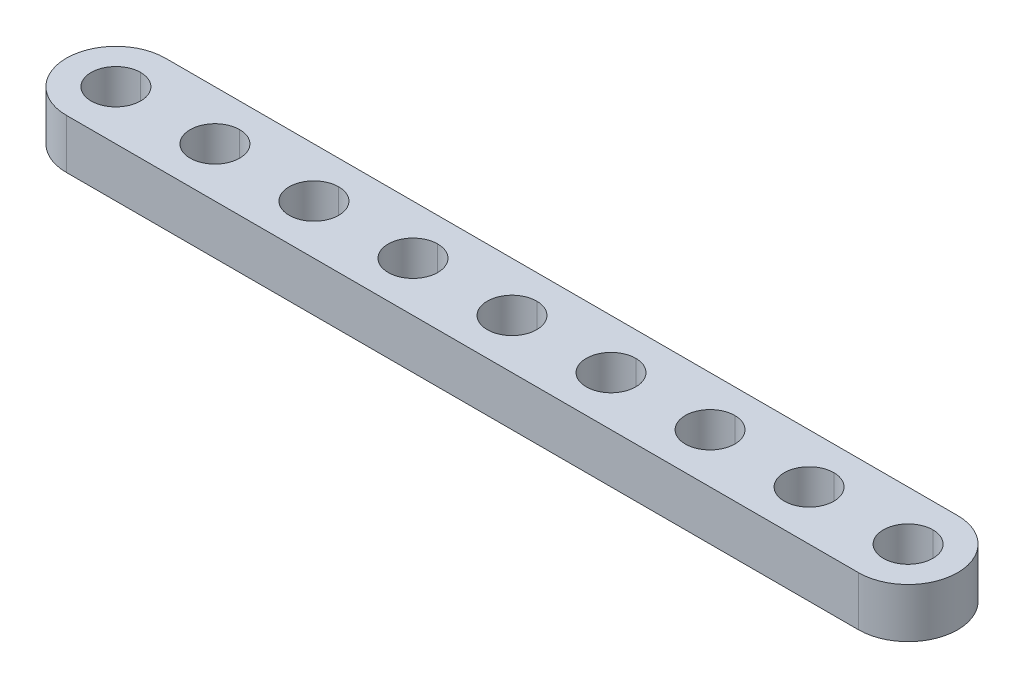
ISO-10303-21;
HEADER;
FILE_DESCRIPTION(('STEP AP214'),'2;1');
FILE_NAME('part.step','',(''),(''),'','','');
FILE_SCHEMA(('AUTOMOTIVE_DESIGN { 1 0 10303 214 1 1 1 1 }'));
ENDSEC;
DATA;
#1=APPLICATION_CONTEXT('core data for automotive mechanical design processes');
#2=APPLICATION_PROTOCOL_DEFINITION('international standard','automotive_design',2000,#1);
#3=PRODUCT_CONTEXT('',#1,'mechanical');
#4=PRODUCT('Part','Part','',(#3));
#5=PRODUCT_RELATED_PRODUCT_CATEGORY('part','',(#4));
#6=PRODUCT_DEFINITION_FORMATION('','',#4);
#7=PRODUCT_DEFINITION_CONTEXT('part definition',#1,'design');
#8=PRODUCT_DEFINITION('design','',#6,#7);
#9=PRODUCT_DEFINITION_SHAPE('','',#8);
#10=(LENGTH_UNIT() NAMED_UNIT(*) SI_UNIT(.MILLI.,.METRE.));
#11=(NAMED_UNIT(*) PLANE_ANGLE_UNIT() SI_UNIT($,.RADIAN.));
#12=(NAMED_UNIT(*) SI_UNIT($,.STERADIAN.) SOLID_ANGLE_UNIT());
#13=UNCERTAINTY_MEASURE_WITH_UNIT(LENGTH_MEASURE(1.E-05),#10,'distance_accuracy_value','');
#14=(GEOMETRIC_REPRESENTATION_CONTEXT(3) GLOBAL_UNCERTAINTY_ASSIGNED_CONTEXT((#13)) GLOBAL_UNIT_ASSIGNED_CONTEXT((#10,
#11,#12)) REPRESENTATION_CONTEXT('',''));
#15=CARTESIAN_POINT('',(0.,0.,0.));
#16=DIRECTION('',(0.,0.,1.));
#17=DIRECTION('',(1.,0.,0.));
#18=AXIS2_PLACEMENT_3D('',#15,#16,#17);
#19=CARTESIAN_POINT('',(32.,4.,0.));
#20=DIRECTION('',(0.,1.,0.));
#21=DIRECTION('',(0.,0.,1.));
#22=AXIS2_PLACEMENT_3D('',#19,#20,#21);
#23=CYLINDRICAL_SURFACE('',#22,2.);
#24=DIRECTION('',(0.,1.,0.));
#25=VECTOR('',#24,1.);
#26=CARTESIAN_POINT('',(32.,4.,-2.));
#27=LINE('',#26,#25);
#28=CARTESIAN_POINT('',(32.,0.,-2.));
#29=VERTEX_POINT('',#28);
#30=CARTESIAN_POINT('',(32.,4.,-2.));
#31=VERTEX_POINT('',#30);
#32=EDGE_CURVE('E254',#29,#31,#27,.T.);
#33=ORIENTED_EDGE('',*,*,#32,.F.);
#34=CARTESIAN_POINT('',(32.,0.,0.));
#35=DIRECTION('',(0.,1.,0.));
#36=DIRECTION('',(0.,0.,1.));
#37=AXIS2_PLACEMENT_3D('',#34,#35,#36);
#38=CIRCLE('',#37,2.);
#39=CARTESIAN_POINT('',(32.,0.,2.));
#40=VERTEX_POINT('',#39);
#41=EDGE_CURVE('E212',#40,#29,#38,.T.);
#42=ORIENTED_EDGE('',*,*,#41,.F.);
#43=DIRECTION('',(0.,1.,0.));
#44=VECTOR('',#43,1.);
#45=CARTESIAN_POINT('',(32.,4.,2.));
#46=LINE('',#45,#44);
#47=CARTESIAN_POINT('',(32.,4.,2.));
#48=VERTEX_POINT('',#47);
#49=EDGE_CURVE('E305',#40,#48,#46,.T.);
#50=ORIENTED_EDGE('',*,*,#49,.T.);
#51=CARTESIAN_POINT('',(32.,4.,0.));
#52=DIRECTION('',(0.,1.,0.));
#53=DIRECTION('',(0.,0.,1.));
#54=AXIS2_PLACEMENT_3D('',#51,#52,#53);
#55=CIRCLE('',#54,2.);
#56=EDGE_CURVE('E237',#48,#31,#55,.T.);
#57=ORIENTED_EDGE('',*,*,#56,.T.);
#58=EDGE_LOOP('',(#33,#42,#50,#57));
#59=FACE_BOUND('',#58,.T.);
#60=ADVANCED_FACE('F15',(#59),#23,.F.);
#61=CARTESIAN_POINT('',(24.,4.,0.));
#62=DIRECTION('',(0.,1.,0.));
#63=DIRECTION('',(0.,0.,1.));
#64=AXIS2_PLACEMENT_3D('',#61,#62,#63);
#65=CYLINDRICAL_SURFACE('',#64,2.);
#66=DIRECTION('',(0.,1.,0.));
#67=VECTOR('',#66,1.);
#68=CARTESIAN_POINT('',(24.,4.,-2.));
#69=LINE('',#68,#67);
#70=CARTESIAN_POINT('',(24.,0.,-2.));
#71=VERTEX_POINT('',#70);
#72=CARTESIAN_POINT('',(24.,4.,-2.));
#73=VERTEX_POINT('',#72);
#74=EDGE_CURVE('E19',#71,#73,#69,.T.);
#75=ORIENTED_EDGE('',*,*,#74,.F.);
#76=CARTESIAN_POINT('',(24.,0.,0.));
#77=DIRECTION('',(0.,1.,0.));
#78=DIRECTION('',(0.,0.,1.));
#79=AXIS2_PLACEMENT_3D('',#76,#77,#78);
#80=CIRCLE('',#79,2.);
#81=CARTESIAN_POINT('',(24.,0.,2.));
#82=VERTEX_POINT('',#81);
#83=EDGE_CURVE('E209',#82,#71,#80,.T.);
#84=ORIENTED_EDGE('',*,*,#83,.F.);
#85=DIRECTION('',(0.,1.,0.));
#86=VECTOR('',#85,1.);
#87=CARTESIAN_POINT('',(24.,4.,2.));
#88=LINE('',#87,#86);
#89=CARTESIAN_POINT('',(24.,4.,2.));
#90=VERTEX_POINT('',#89);
#91=EDGE_CURVE('E366',#82,#90,#88,.T.);
#92=ORIENTED_EDGE('',*,*,#91,.T.);
#93=CARTESIAN_POINT('',(24.,4.,0.));
#94=DIRECTION('',(0.,1.,0.));
#95=DIRECTION('',(0.,0.,1.));
#96=AXIS2_PLACEMENT_3D('',#93,#94,#95);
#97=CIRCLE('',#96,2.);
#98=EDGE_CURVE('E241',#90,#73,#97,.T.);
#99=ORIENTED_EDGE('',*,*,#98,.T.);
#100=EDGE_LOOP('',(#75,#84,#92,#99));
#101=FACE_BOUND('',#100,.T.);
#102=ADVANCED_FACE('F540',(#101),#65,.F.);
#103=CARTESIAN_POINT('',(16.,4.,0.));
#104=DIRECTION('',(0.,1.,0.));
#105=DIRECTION('',(0.,0.,1.));
#106=AXIS2_PLACEMENT_3D('',#103,#104,#105);
#107=CYLINDRICAL_SURFACE('',#106,2.);
#108=DIRECTION('',(0.,1.,0.));
#109=VECTOR('',#108,1.);
#110=CARTESIAN_POINT('',(16.,4.,-2.));
#111=LINE('',#110,#109);
#112=CARTESIAN_POINT('',(16.,0.,-2.));
#113=VERTEX_POINT('',#112);
#114=CARTESIAN_POINT('',(16.,4.,-2.));
#115=VERTEX_POINT('',#114);
#116=EDGE_CURVE('E447',#113,#115,#111,.T.);
#117=ORIENTED_EDGE('',*,*,#116,.F.);
#118=CARTESIAN_POINT('',(16.,0.,0.));
#119=DIRECTION('',(0.,1.,0.));
#120=DIRECTION('',(0.,0.,1.));
#121=AXIS2_PLACEMENT_3D('',#118,#119,#120);
#122=CIRCLE('',#121,2.);
#123=CARTESIAN_POINT('',(16.,0.,2.));
#124=VERTEX_POINT('',#123);
#125=EDGE_CURVE('E211',#124,#113,#122,.T.);
#126=ORIENTED_EDGE('',*,*,#125,.F.);
#127=DIRECTION('',(0.,1.,0.));
#128=VECTOR('',#127,1.);
#129=CARTESIAN_POINT('',(16.,4.,2.));
#130=LINE('',#129,#128);
#131=CARTESIAN_POINT('',(16.,4.,2.));
#132=VERTEX_POINT('',#131);
#133=EDGE_CURVE('E398',#124,#132,#130,.T.);
#134=ORIENTED_EDGE('',*,*,#133,.T.);
#135=CARTESIAN_POINT('',(16.,4.,0.));
#136=DIRECTION('',(0.,1.,0.));
#137=DIRECTION('',(0.,0.,1.));
#138=AXIS2_PLACEMENT_3D('',#135,#136,#137);
#139=CIRCLE('',#138,2.);
#140=EDGE_CURVE('E257',#132,#115,#139,.T.);
#141=ORIENTED_EDGE('',*,*,#140,.T.);
#142=EDGE_LOOP('',(#117,#126,#134,#141));
#143=FACE_BOUND('',#142,.T.);
#144=ADVANCED_FACE('F444',(#143),#107,.F.);
#145=CARTESIAN_POINT('',(8.,4.,0.));
#146=DIRECTION('',(0.,1.,0.));
#147=DIRECTION('',(0.,0.,1.));
#148=AXIS2_PLACEMENT_3D('',#145,#146,#147);
#149=CYLINDRICAL_SURFACE('',#148,2.);
#150=DIRECTION('',(0.,1.,0.));
#151=VECTOR('',#150,1.);
#152=CARTESIAN_POINT('',(8.,4.,-2.));
#153=LINE('',#152,#151);
#154=CARTESIAN_POINT('',(8.,0.,-2.));
#155=VERTEX_POINT('',#154);
#156=CARTESIAN_POINT('',(8.,4.,-2.));
#157=VERTEX_POINT('',#156);
#158=EDGE_CURVE('E285',#155,#157,#153,.T.);
#159=ORIENTED_EDGE('',*,*,#158,.F.);
#160=CARTESIAN_POINT('',(8.,0.,0.));
#161=DIRECTION('',(0.,1.,0.));
#162=DIRECTION('',(0.,0.,1.));
#163=AXIS2_PLACEMENT_3D('',#160,#161,#162);
#164=CIRCLE('',#163,2.);
#165=CARTESIAN_POINT('',(8.,0.,2.));
#166=VERTEX_POINT('',#165);
#167=EDGE_CURVE('E300',#166,#155,#164,.T.);
#168=ORIENTED_EDGE('',*,*,#167,.F.);
#169=DIRECTION('',(0.,1.,0.));
#170=VECTOR('',#169,1.);
#171=CARTESIAN_POINT('',(8.,4.,2.));
#172=LINE('',#171,#170);
#173=CARTESIAN_POINT('',(8.,4.,2.));
#174=VERTEX_POINT('',#173);
#175=EDGE_CURVE('E227',#166,#174,#172,.T.);
#176=ORIENTED_EDGE('',*,*,#175,.T.);
#177=CARTESIAN_POINT('',(8.,4.,0.));
#178=DIRECTION('',(0.,1.,0.));
#179=DIRECTION('',(0.,0.,1.));
#180=AXIS2_PLACEMENT_3D('',#177,#178,#179);
#181=CIRCLE('',#180,2.);
#182=EDGE_CURVE('E259',#174,#157,#181,.T.);
#183=ORIENTED_EDGE('',*,*,#182,.T.);
#184=EDGE_LOOP('',(#159,#168,#176,#183));
#185=FACE_BOUND('',#184,.T.);
#186=ADVANCED_FACE('F518',(#185),#149,.F.);
#187=CARTESIAN_POINT('',(0.,4.,0.));
#188=DIRECTION('',(0.,1.,0.));
#189=DIRECTION('',(0.,0.,1.));
#190=AXIS2_PLACEMENT_3D('',#187,#188,#189);
#191=CYLINDRICAL_SURFACE('',#190,2.);
#192=DIRECTION('',(0.,1.,0.));
#193=VECTOR('',#192,1.);
#194=CARTESIAN_POINT('',(0.,4.,-2.));
#195=LINE('',#194,#193);
#196=CARTESIAN_POINT('',(0.,0.,-2.));
#197=VERTEX_POINT('',#196);
#198=CARTESIAN_POINT('',(0.,4.,-2.));
#199=VERTEX_POINT('',#198);
#200=EDGE_CURVE('E213',#197,#199,#195,.T.);
#201=ORIENTED_EDGE('',*,*,#200,.F.);
#202=CARTESIAN_POINT('',(0.,0.,0.));
#203=DIRECTION('',(0.,1.,0.));
#204=DIRECTION('',(0.,0.,1.));
#205=AXIS2_PLACEMENT_3D('',#202,#203,#204);
#206=CIRCLE('',#205,2.);
#207=CARTESIAN_POINT('',(0.,0.,2.));
#208=VERTEX_POINT('',#207);
#209=EDGE_CURVE('E178',#208,#197,#206,.T.);
#210=ORIENTED_EDGE('',*,*,#209,.F.);
#211=DIRECTION('',(0.,1.,0.));
#212=VECTOR('',#211,1.);
#213=CARTESIAN_POINT('',(0.,4.,2.));
#214=LINE('',#213,#212);
#215=CARTESIAN_POINT('',(0.,4.,2.));
#216=VERTEX_POINT('',#215);
#217=EDGE_CURVE('E195',#208,#216,#214,.T.);
#218=ORIENTED_EDGE('',*,*,#217,.T.);
#219=CARTESIAN_POINT('',(0.,4.,0.));
#220=DIRECTION('',(0.,1.,0.));
#221=DIRECTION('',(0.,0.,1.));
#222=AXIS2_PLACEMENT_3D('',#219,#220,#221);
#223=CIRCLE('',#222,2.);
#224=EDGE_CURVE('E278',#216,#199,#223,.T.);
#225=ORIENTED_EDGE('',*,*,#224,.T.);
#226=EDGE_LOOP('',(#201,#210,#218,#225));
#227=FACE_BOUND('',#226,.T.);
#228=ADVANCED_FACE('F575',(#227),#191,.F.);
#229=CARTESIAN_POINT('',(-8.,4.,0.));
#230=DIRECTION('',(0.,1.,0.));
#231=DIRECTION('',(0.,0.,1.));
#232=AXIS2_PLACEMENT_3D('',#229,#230,#231);
#233=CYLINDRICAL_SURFACE('',#232,2.);
#234=DIRECTION('',(0.,1.,0.));
#235=VECTOR('',#234,1.);
#236=CARTESIAN_POINT('',(-8.,4.,-2.));
#237=LINE('',#236,#235);
#238=CARTESIAN_POINT('',(-8.,0.,-2.));
#239=VERTEX_POINT('',#238);
#240=CARTESIAN_POINT('',(-8.,4.,-2.));
#241=VERTEX_POINT('',#240);
#242=EDGE_CURVE('E182',#239,#241,#237,.T.);
#243=ORIENTED_EDGE('',*,*,#242,.F.);
#244=CARTESIAN_POINT('',(-8.,0.,0.));
#245=DIRECTION('',(0.,1.,0.));
#246=DIRECTION('',(0.,0.,1.));
#247=AXIS2_PLACEMENT_3D('',#244,#245,#246);
#248=CIRCLE('',#247,2.);
#249=CARTESIAN_POINT('',(-8.,0.,2.));
#250=VERTEX_POINT('',#249);
#251=EDGE_CURVE('E167',#250,#239,#248,.T.);
#252=ORIENTED_EDGE('',*,*,#251,.F.);
#253=DIRECTION('',(0.,1.,0.));
#254=VECTOR('',#253,1.);
#255=CARTESIAN_POINT('',(-8.,4.,2.));
#256=LINE('',#255,#254);
#257=CARTESIAN_POINT('',(-8.,4.,2.));
#258=VERTEX_POINT('',#257);
#259=EDGE_CURVE('E193',#250,#258,#256,.T.);
#260=ORIENTED_EDGE('',*,*,#259,.T.);
#261=CARTESIAN_POINT('',(-8.,4.,0.));
#262=DIRECTION('',(0.,1.,0.));
#263=DIRECTION('',(0.,0.,1.));
#264=AXIS2_PLACEMENT_3D('',#261,#262,#263);
#265=CIRCLE('',#264,2.);
#266=EDGE_CURVE('E185',#258,#241,#265,.T.);
#267=ORIENTED_EDGE('',*,*,#266,.T.);
#268=EDGE_LOOP('',(#243,#252,#260,#267));
#269=FACE_BOUND('',#268,.T.);
#270=ADVANCED_FACE('F183',(#269),#233,.F.);
#271=CARTESIAN_POINT('',(-16.,4.,0.));
#272=DIRECTION('',(0.,1.,0.));
#273=DIRECTION('',(0.,0.,1.));
#274=AXIS2_PLACEMENT_3D('',#271,#272,#273);
#275=CYLINDRICAL_SURFACE('',#274,2.);
#276=DIRECTION('',(0.,1.,0.));
#277=VECTOR('',#276,1.);
#278=CARTESIAN_POINT('',(-16.,4.,-2.));
#279=LINE('',#278,#277);
#280=CARTESIAN_POINT('',(-16.,0.,-2.));
#281=VERTEX_POINT('',#280);
#282=CARTESIAN_POINT('',(-16.,4.,-2.));
#283=VERTEX_POINT('',#282);
#284=EDGE_CURVE('E339',#281,#283,#279,.T.);
#285=ORIENTED_EDGE('',*,*,#284,.F.);
#286=CARTESIAN_POINT('',(-16.,0.,0.));
#287=DIRECTION('',(0.,1.,0.));
#288=DIRECTION('',(0.,0.,1.));
#289=AXIS2_PLACEMENT_3D('',#286,#287,#288);
#290=CIRCLE('',#289,2.);
#291=CARTESIAN_POINT('',(-16.,0.,2.));
#292=VERTEX_POINT('',#291);
#293=EDGE_CURVE('E177',#292,#281,#290,.T.);
#294=ORIENTED_EDGE('',*,*,#293,.F.);
#295=DIRECTION('',(0.,1.,0.));
#296=VECTOR('',#295,1.);
#297=CARTESIAN_POINT('',(-16.,4.,2.));
#298=LINE('',#297,#296);
#299=CARTESIAN_POINT('',(-16.,4.,2.));
#300=VERTEX_POINT('',#299);
#301=EDGE_CURVE('E323',#292,#300,#298,.T.);
#302=ORIENTED_EDGE('',*,*,#301,.T.);
#303=CARTESIAN_POINT('',(-16.,4.,0.));
#304=DIRECTION('',(0.,1.,0.));
#305=DIRECTION('',(0.,0.,1.));
#306=AXIS2_PLACEMENT_3D('',#303,#304,#305);
#307=CIRCLE('',#306,2.);
#308=EDGE_CURVE('E271',#300,#283,#307,.T.);
#309=ORIENTED_EDGE('',*,*,#308,.T.);
#310=EDGE_LOOP('',(#285,#294,#302,#309));
#311=FACE_BOUND('',#310,.T.);
#312=ADVANCED_FACE('F582',(#311),#275,.F.);
#313=CARTESIAN_POINT('',(-24.,4.,0.));
#314=DIRECTION('',(0.,1.,0.));
#315=DIRECTION('',(0.,0.,1.));
#316=AXIS2_PLACEMENT_3D('',#313,#314,#315);
#317=CYLINDRICAL_SURFACE('',#316,2.);
#318=DIRECTION('',(0.,1.,0.));
#319=VECTOR('',#318,1.);
#320=CARTESIAN_POINT('',(-24.,4.,-2.));
#321=LINE('',#320,#319);
#322=CARTESIAN_POINT('',(-24.,0.,-2.));
#323=VERTEX_POINT('',#322);
#324=CARTESIAN_POINT('',(-24.,4.,-2.));
#325=VERTEX_POINT('',#324);
#326=EDGE_CURVE('E228',#323,#325,#321,.T.);
#327=ORIENTED_EDGE('',*,*,#326,.F.);
#328=CARTESIAN_POINT('',(-24.,0.,0.));
#329=DIRECTION('',(0.,1.,0.));
#330=DIRECTION('',(0.,0.,1.));
#331=AXIS2_PLACEMENT_3D('',#328,#329,#330);
#332=CIRCLE('',#331,2.);
#333=CARTESIAN_POINT('',(-24.,0.,2.));
#334=VERTEX_POINT('',#333);
#335=EDGE_CURVE('E26',#334,#323,#332,.T.);
#336=ORIENTED_EDGE('',*,*,#335,.F.);
#337=DIRECTION('',(0.,1.,0.));
#338=VECTOR('',#337,1.);
#339=CARTESIAN_POINT('',(-24.,4.,2.));
#340=LINE('',#339,#338);
#341=CARTESIAN_POINT('',(-24.,4.,2.));
#342=VERTEX_POINT('',#341);
#343=EDGE_CURVE('E261',#334,#342,#340,.T.);
#344=ORIENTED_EDGE('',*,*,#343,.T.);
#345=CARTESIAN_POINT('',(-24.,4.,0.));
#346=DIRECTION('',(0.,1.,0.));
#347=DIRECTION('',(0.,0.,1.));
#348=AXIS2_PLACEMENT_3D('',#345,#346,#347);
#349=CIRCLE('',#348,2.);
#350=EDGE_CURVE('E207',#342,#325,#349,.T.);
#351=ORIENTED_EDGE('',*,*,#350,.T.);
#352=EDGE_LOOP('',(#327,#336,#344,#351));
#353=FACE_BOUND('',#352,.T.);
#354=ADVANCED_FACE('F485',(#353),#317,.F.);
#355=CARTESIAN_POINT('',(-32.,4.,0.));
#356=DIRECTION('',(0.,1.,0.));
#357=DIRECTION('',(0.,0.,1.));
#358=AXIS2_PLACEMENT_3D('',#355,#356,#357);
#359=CYLINDRICAL_SURFACE('',#358,2.);
#360=DIRECTION('',(0.,1.,0.));
#361=VECTOR('',#360,1.);
#362=CARTESIAN_POINT('',(-32.,4.,-2.));
#363=LINE('',#362,#361);
#364=CARTESIAN_POINT('',(-32.,0.,-2.));
#365=VERTEX_POINT('',#364);
#366=CARTESIAN_POINT('',(-32.,4.,-2.));
#367=VERTEX_POINT('',#366);
#368=EDGE_CURVE('E293',#365,#367,#363,.T.);
#369=ORIENTED_EDGE('',*,*,#368,.F.);
#370=CARTESIAN_POINT('',(-32.,0.,0.));
#371=DIRECTION('',(0.,1.,0.));
#372=DIRECTION('',(0.,0.,1.));
#373=AXIS2_PLACEMENT_3D('',#370,#371,#372);
#374=CIRCLE('',#373,2.);
#375=CARTESIAN_POINT('',(-32.,0.,2.));
#376=VERTEX_POINT('',#375);
#377=EDGE_CURVE('E10',#376,#365,#374,.T.);
#378=ORIENTED_EDGE('',*,*,#377,.F.);
#379=DIRECTION('',(0.,1.,0.));
#380=VECTOR('',#379,1.);
#381=CARTESIAN_POINT('',(-32.,4.,2.));
#382=LINE('',#381,#380);
#383=CARTESIAN_POINT('',(-32.,4.,2.));
#384=VERTEX_POINT('',#383);
#385=EDGE_CURVE('E247',#376,#384,#382,.T.);
#386=ORIENTED_EDGE('',*,*,#385,.T.);
#387=CARTESIAN_POINT('',(-32.,4.,0.));
#388=DIRECTION('',(0.,1.,0.));
#389=DIRECTION('',(0.,0.,1.));
#390=AXIS2_PLACEMENT_3D('',#387,#388,#389);
#391=CIRCLE('',#390,2.);
#392=EDGE_CURVE('E371',#384,#367,#391,.T.);
#393=ORIENTED_EDGE('',*,*,#392,.T.);
#394=EDGE_LOOP('',(#369,#378,#386,#393));
#395=FACE_BOUND('',#394,.T.);
#396=ADVANCED_FACE('F527',(#395),#359,.F.);
#397=CARTESIAN_POINT('',(-32.,0.,0.));
#398=DIRECTION('',(0.,1.,0.));
#399=DIRECTION('',(1.,0.,0.));
#400=AXIS2_PLACEMENT_3D('',#397,#398,#399);
#401=PLANE('',#400);
#402=ORIENTED_EDGE('',*,*,#377,.T.);
#403=CARTESIAN_POINT('',(-32.,0.,0.));
#404=DIRECTION('',(0.,1.,0.));
#405=DIRECTION('',(0.,0.,1.));
#406=AXIS2_PLACEMENT_3D('',#403,#404,#405);
#407=CIRCLE('',#406,2.);
#408=EDGE_CURVE('E265',#365,#376,#407,.T.);
#409=ORIENTED_EDGE('',*,*,#408,.T.);
#410=EDGE_LOOP('',(#402,#409));
#411=FACE_BOUND('',#410,.T.);
#412=ORIENTED_EDGE('',*,*,#335,.T.);
#413=CARTESIAN_POINT('',(-24.,0.,0.));
#414=DIRECTION('',(0.,1.,0.));
#415=DIRECTION('',(0.,0.,1.));
#416=AXIS2_PLACEMENT_3D('',#413,#414,#415);
#417=CIRCLE('',#416,2.);
#418=EDGE_CURVE('E233',#323,#334,#417,.T.);
#419=ORIENTED_EDGE('',*,*,#418,.T.);
#420=EDGE_LOOP('',(#412,#419));
#421=FACE_BOUND('',#420,.T.);
#422=ORIENTED_EDGE('',*,*,#293,.T.);
#423=CARTESIAN_POINT('',(-16.,0.,0.));
#424=DIRECTION('',(0.,1.,0.));
#425=DIRECTION('',(0.,0.,1.));
#426=AXIS2_PLACEMENT_3D('',#423,#424,#425);
#427=CIRCLE('',#426,2.);
#428=EDGE_CURVE('E288',#281,#292,#427,.T.);
#429=ORIENTED_EDGE('',*,*,#428,.T.);
#430=EDGE_LOOP('',(#422,#429));
#431=FACE_BOUND('',#430,.T.);
#432=ORIENTED_EDGE('',*,*,#251,.T.);
#433=CARTESIAN_POINT('',(-8.,0.,0.));
#434=DIRECTION('',(0.,1.,0.));
#435=DIRECTION('',(0.,0.,1.));
#436=AXIS2_PLACEMENT_3D('',#433,#434,#435);
#437=CIRCLE('',#436,2.);
#438=EDGE_CURVE('E172',#239,#250,#437,.T.);
#439=ORIENTED_EDGE('',*,*,#438,.T.);
#440=EDGE_LOOP('',(#432,#439));
#441=FACE_BOUND('',#440,.T.);
#442=ORIENTED_EDGE('',*,*,#209,.T.);
#443=CARTESIAN_POINT('',(0.,0.,0.));
#444=DIRECTION('',(0.,1.,0.));
#445=DIRECTION('',(0.,0.,1.));
#446=AXIS2_PLACEMENT_3D('',#443,#444,#445);
#447=CIRCLE('',#446,2.);
#448=EDGE_CURVE('E217',#197,#208,#447,.T.);
#449=ORIENTED_EDGE('',*,*,#448,.T.);
#450=EDGE_LOOP('',(#442,#449));
#451=FACE_BOUND('',#450,.T.);
#452=ORIENTED_EDGE('',*,*,#167,.T.);
#453=CARTESIAN_POINT('',(8.,0.,0.));
#454=DIRECTION('',(0.,1.,0.));
#455=DIRECTION('',(0.,0.,1.));
#456=AXIS2_PLACEMENT_3D('',#453,#454,#455);
#457=CIRCLE('',#456,2.);
#458=EDGE_CURVE('E387',#155,#166,#457,.T.);
#459=ORIENTED_EDGE('',*,*,#458,.T.);
#460=EDGE_LOOP('',(#452,#459));
#461=FACE_BOUND('',#460,.T.);
#462=ORIENTED_EDGE('',*,*,#125,.T.);
#463=CARTESIAN_POINT('',(16.,0.,0.));
#464=DIRECTION('',(0.,1.,0.));
#465=DIRECTION('',(0.,0.,1.));
#466=AXIS2_PLACEMENT_3D('',#463,#464,#465);
#467=CIRCLE('',#466,2.);
#468=EDGE_CURVE('E453',#113,#124,#467,.T.);
#469=ORIENTED_EDGE('',*,*,#468,.T.);
#470=EDGE_LOOP('',(#462,#469));
#471=FACE_BOUND('',#470,.T.);
#472=ORIENTED_EDGE('',*,*,#83,.T.);
#473=CARTESIAN_POINT('',(24.,0.,0.));
#474=DIRECTION('',(0.,1.,0.));
#475=DIRECTION('',(0.,0.,1.));
#476=AXIS2_PLACEMENT_3D('',#473,#474,#475);
#477=CIRCLE('',#476,2.);
#478=EDGE_CURVE('E336',#71,#82,#477,.T.);
#479=ORIENTED_EDGE('',*,*,#478,.T.);
#480=EDGE_LOOP('',(#472,#479));
#481=FACE_BOUND('',#480,.T.);
#482=ORIENTED_EDGE('',*,*,#41,.T.);
#483=CARTESIAN_POINT('',(32.,0.,0.));
#484=DIRECTION('',(0.,1.,0.));
#485=DIRECTION('',(0.,0.,1.));
#486=AXIS2_PLACEMENT_3D('',#483,#484,#485);
#487=CIRCLE('',#486,2.);
#488=EDGE_CURVE('E250',#29,#40,#487,.T.);
#489=ORIENTED_EDGE('',*,*,#488,.T.);
#490=EDGE_LOOP('',(#482,#489));
#491=FACE_BOUND('',#490,.T.);
#492=CARTESIAN_POINT('',(-32.,0.,0.));
#493=DIRECTION('',(0.,1.,0.));
#494=DIRECTION('',(0.,0.,1.));
#495=AXIS2_PLACEMENT_3D('',#492,#493,#494);
#496=CIRCLE('',#495,4.);
#497=CARTESIAN_POINT('',(-32.,0.,-4.));
#498=VERTEX_POINT('',#497);
#499=CARTESIAN_POINT('',(-32.,0.,4.));
#500=VERTEX_POINT('',#499);
#501=EDGE_CURVE('E242',#498,#500,#496,.T.);
#502=ORIENTED_EDGE('',*,*,#501,.F.);
#503=DIRECTION('',(-1.,0.,0.));
#504=VECTOR('',#503,1.);
#505=CARTESIAN_POINT('',(-32.,0.,-4.));
#506=LINE('',#505,#504);
#507=CARTESIAN_POINT('',(32.,0.,-4.));
#508=VERTEX_POINT('',#507);
#509=EDGE_CURVE('E289',#508,#498,#506,.T.);
#510=ORIENTED_EDGE('',*,*,#509,.F.);
#511=CARTESIAN_POINT('',(32.,0.,0.));
#512=DIRECTION('',(0.,1.,0.));
#513=DIRECTION('',(0.,0.,1.));
#514=AXIS2_PLACEMENT_3D('',#511,#512,#513);
#515=CIRCLE('',#514,4.);
#516=CARTESIAN_POINT('',(32.,0.,4.));
#517=VERTEX_POINT('',#516);
#518=EDGE_CURVE('E218',#517,#508,#515,.T.);
#519=ORIENTED_EDGE('',*,*,#518,.F.);
#520=DIRECTION('',(1.,0.,0.));
#521=VECTOR('',#520,1.);
#522=CARTESIAN_POINT('',(-32.,0.,4.));
#523=LINE('',#522,#521);
#524=EDGE_CURVE('E312',#500,#517,#523,.T.);
#525=ORIENTED_EDGE('',*,*,#524,.F.);
#526=EDGE_LOOP('',(#502,#510,#519,#525));
#527=FACE_BOUND('',#526,.T.);
#528=ADVANCED_FACE('F169',(#411,#421,#431,#441,#451,#461,#471,#481,#491,#527),#401,.F.);
#529=CARTESIAN_POINT('',(-32.,4.,0.));
#530=DIRECTION('',(0.,1.,0.));
#531=DIRECTION('',(1.,0.,0.));
#532=AXIS2_PLACEMENT_3D('',#529,#530,#531);
#533=PLANE('',#532);
#534=ORIENTED_EDGE('',*,*,#392,.F.);
#535=CARTESIAN_POINT('',(-32.,4.,0.));
#536=DIRECTION('',(0.,1.,0.));
#537=DIRECTION('',(0.,0.,1.));
#538=AXIS2_PLACEMENT_3D('',#535,#536,#537);
#539=CIRCLE('',#538,2.);
#540=EDGE_CURVE('E297',#367,#384,#539,.T.);
#541=ORIENTED_EDGE('',*,*,#540,.F.);
#542=EDGE_LOOP('',(#534,#541));
#543=FACE_BOUND('',#542,.T.);
#544=ORIENTED_EDGE('',*,*,#350,.F.);
#545=CARTESIAN_POINT('',(-24.,4.,0.));
#546=DIRECTION('',(0.,1.,0.));
#547=DIRECTION('',(0.,0.,1.));
#548=AXIS2_PLACEMENT_3D('',#545,#546,#547);
#549=CIRCLE('',#548,2.);
#550=EDGE_CURVE('E232',#325,#342,#549,.T.);
#551=ORIENTED_EDGE('',*,*,#550,.F.);
#552=EDGE_LOOP('',(#544,#551));
#553=FACE_BOUND('',#552,.T.);
#554=ORIENTED_EDGE('',*,*,#308,.F.);
#555=CARTESIAN_POINT('',(-16.,4.,0.));
#556=DIRECTION('',(0.,1.,0.));
#557=DIRECTION('',(0.,0.,1.));
#558=AXIS2_PLACEMENT_3D('',#555,#556,#557);
#559=CIRCLE('',#558,2.);
#560=EDGE_CURVE('E327',#283,#300,#559,.T.);
#561=ORIENTED_EDGE('',*,*,#560,.F.);
#562=EDGE_LOOP('',(#554,#561));
#563=FACE_BOUND('',#562,.T.);
#564=ORIENTED_EDGE('',*,*,#266,.F.);
#565=CARTESIAN_POINT('',(-8.,4.,0.));
#566=DIRECTION('',(0.,1.,0.));
#567=DIRECTION('',(0.,0.,1.));
#568=AXIS2_PLACEMENT_3D('',#565,#566,#567);
#569=CIRCLE('',#568,2.);
#570=EDGE_CURVE('E190',#241,#258,#569,.T.);
#571=ORIENTED_EDGE('',*,*,#570,.F.);
#572=EDGE_LOOP('',(#564,#571));
#573=FACE_BOUND('',#572,.T.);
#574=ORIENTED_EDGE('',*,*,#224,.F.);
#575=CARTESIAN_POINT('',(0.,4.,0.));
#576=DIRECTION('',(0.,1.,0.));
#577=DIRECTION('',(0.,0.,1.));
#578=AXIS2_PLACEMENT_3D('',#575,#576,#577);
#579=CIRCLE('',#578,2.);
#580=EDGE_CURVE('E203',#199,#216,#579,.T.);
#581=ORIENTED_EDGE('',*,*,#580,.F.);
#582=EDGE_LOOP('',(#574,#581));
#583=FACE_BOUND('',#582,.T.);
#584=ORIENTED_EDGE('',*,*,#182,.F.);
#585=CARTESIAN_POINT('',(8.,4.,0.));
#586=DIRECTION('',(0.,1.,0.));
#587=DIRECTION('',(0.,0.,1.));
#588=AXIS2_PLACEMENT_3D('',#585,#586,#587);
#589=CIRCLE('',#588,2.);
#590=EDGE_CURVE('E281',#157,#174,#589,.T.);
#591=ORIENTED_EDGE('',*,*,#590,.F.);
#592=EDGE_LOOP('',(#584,#591));
#593=FACE_BOUND('',#592,.T.);
#594=ORIENTED_EDGE('',*,*,#140,.F.);
#595=CARTESIAN_POINT('',(16.,4.,0.));
#596=DIRECTION('',(0.,1.,0.));
#597=DIRECTION('',(0.,0.,1.));
#598=AXIS2_PLACEMENT_3D('',#595,#596,#597);
#599=CIRCLE('',#598,2.);
#600=EDGE_CURVE('E402',#115,#132,#599,.T.);
#601=ORIENTED_EDGE('',*,*,#600,.F.);
#602=EDGE_LOOP('',(#594,#601));
#603=FACE_BOUND('',#602,.T.);
#604=ORIENTED_EDGE('',*,*,#98,.F.);
#605=CARTESIAN_POINT('',(24.,4.,0.));
#606=DIRECTION('',(0.,1.,0.));
#607=DIRECTION('',(0.,0.,1.));
#608=AXIS2_PLACEMENT_3D('',#605,#606,#607);
#609=CIRCLE('',#608,2.);
#610=EDGE_CURVE('E372',#73,#90,#609,.T.);
#611=ORIENTED_EDGE('',*,*,#610,.F.);
#612=EDGE_LOOP('',(#604,#611));
#613=FACE_BOUND('',#612,.T.);
#614=ORIENTED_EDGE('',*,*,#56,.F.);
#615=CARTESIAN_POINT('',(32.,4.,0.));
#616=DIRECTION('',(0.,1.,0.));
#617=DIRECTION('',(0.,0.,1.));
#618=AXIS2_PLACEMENT_3D('',#615,#616,#617);
#619=CIRCLE('',#618,2.);
#620=EDGE_CURVE('E301',#31,#48,#619,.T.);
#621=ORIENTED_EDGE('',*,*,#620,.F.);
#622=EDGE_LOOP('',(#614,#621));
#623=FACE_BOUND('',#622,.T.);
#624=CARTESIAN_POINT('',(-32.,4.,0.));
#625=DIRECTION('',(0.,1.,0.));
#626=DIRECTION('',(0.,0.,1.));
#627=AXIS2_PLACEMENT_3D('',#624,#625,#626);
#628=CIRCLE('',#627,4.);
#629=CARTESIAN_POINT('',(-32.,4.,-4.));
#630=VERTEX_POINT('',#629);
#631=CARTESIAN_POINT('',(-32.,4.,4.));
#632=VERTEX_POINT('',#631);
#633=EDGE_CURVE('E266',#630,#632,#628,.T.);
#634=ORIENTED_EDGE('',*,*,#633,.T.);
#635=DIRECTION('',(1.,0.,0.));
#636=VECTOR('',#635,1.);
#637=CARTESIAN_POINT('',(-32.,4.,4.));
#638=LINE('',#637,#636);
#639=CARTESIAN_POINT('',(32.,4.,4.));
#640=VERTEX_POINT('',#639);
#641=EDGE_CURVE('E223',#632,#640,#638,.T.);
#642=ORIENTED_EDGE('',*,*,#641,.T.);
#643=CARTESIAN_POINT('',(32.,4.,0.));
#644=DIRECTION('',(0.,1.,0.));
#645=DIRECTION('',(0.,0.,1.));
#646=AXIS2_PLACEMENT_3D('',#643,#644,#645);
#647=CIRCLE('',#646,4.);
#648=CARTESIAN_POINT('',(32.,4.,-4.));
#649=VERTEX_POINT('',#648);
#650=EDGE_CURVE('E292',#640,#649,#647,.T.);
#651=ORIENTED_EDGE('',*,*,#650,.T.);
#652=DIRECTION('',(-1.,0.,0.));
#653=VECTOR('',#652,1.);
#654=CARTESIAN_POINT('',(-32.,4.,-4.));
#655=LINE('',#654,#653);
#656=EDGE_CURVE('E41',#649,#630,#655,.T.);
#657=ORIENTED_EDGE('',*,*,#656,.T.);
#658=EDGE_LOOP('',(#634,#642,#651,#657));
#659=FACE_BOUND('',#658,.T.);
#660=ADVANCED_FACE('F424',(#543,#553,#563,#573,#583,#593,#603,#613,#623,#659),#533,.T.);
#661=CARTESIAN_POINT('',(-32.,4.,-4.));
#662=DIRECTION('',(0.,0.,1.));
#663=DIRECTION('',(1.,0.,0.));
#664=AXIS2_PLACEMENT_3D('',#661,#662,#663);
#665=PLANE('',#664);
#666=ORIENTED_EDGE('',*,*,#509,.T.);
#667=DIRECTION('',(0.,-1.,0.));
#668=VECTOR('',#667,1.);
#669=CARTESIAN_POINT('',(-32.,4.,-4.));
#670=LINE('',#669,#668);
#671=EDGE_CURVE('E270',#630,#498,#670,.T.);
#672=ORIENTED_EDGE('',*,*,#671,.F.);
#673=ORIENTED_EDGE('',*,*,#656,.F.);
#674=DIRECTION('',(0.,-1.,0.));
#675=VECTOR('',#674,1.);
#676=CARTESIAN_POINT('',(32.,4.,-4.));
#677=LINE('',#676,#675);
#678=EDGE_CURVE('E222',#649,#508,#677,.T.);
#679=ORIENTED_EDGE('',*,*,#678,.T.);
#680=EDGE_LOOP('',(#666,#672,#673,#679));
#681=FACE_BOUND('',#680,.T.);
#682=ADVANCED_FACE('F534',(#681),#665,.F.);
#683=CARTESIAN_POINT('',(32.,4.,0.));
#684=DIRECTION('',(0.,-1.,0.));
#685=DIRECTION('',(0.,0.,-1.));
#686=AXIS2_PLACEMENT_3D('',#683,#684,#685);
#687=CYLINDRICAL_SURFACE('',#686,4.);
#688=ORIENTED_EDGE('',*,*,#518,.T.);
#689=ORIENTED_EDGE('',*,*,#678,.F.);
#690=ORIENTED_EDGE('',*,*,#650,.F.);
#691=DIRECTION('',(0.,-1.,0.));
#692=VECTOR('',#691,1.);
#693=CARTESIAN_POINT('',(32.,4.,4.));
#694=LINE('',#693,#692);
#695=EDGE_CURVE('E316',#640,#517,#694,.T.);
#696=ORIENTED_EDGE('',*,*,#695,.T.);
#697=EDGE_LOOP('',(#688,#689,#690,#696));
#698=FACE_BOUND('',#697,.T.);
#699=ADVANCED_FACE('F418',(#698),#687,.T.);
#700=CARTESIAN_POINT('',(-32.,4.,4.));
#701=DIRECTION('',(0.,0.,-1.));
#702=DIRECTION('',(0.,-1.,0.));
#703=AXIS2_PLACEMENT_3D('',#700,#701,#702);
#704=PLANE('',#703);
#705=ORIENTED_EDGE('',*,*,#524,.T.);
#706=ORIENTED_EDGE('',*,*,#695,.F.);
#707=ORIENTED_EDGE('',*,*,#641,.F.);
#708=DIRECTION('',(0.,-1.,0.));
#709=VECTOR('',#708,1.);
#710=CARTESIAN_POINT('',(-32.,4.,4.));
#711=LINE('',#710,#709);
#712=EDGE_CURVE('E246',#632,#500,#711,.T.);
#713=ORIENTED_EDGE('',*,*,#712,.T.);
#714=EDGE_LOOP('',(#705,#706,#707,#713));
#715=FACE_BOUND('',#714,.T.);
#716=ADVANCED_FACE('F17',(#715),#704,.F.);
#717=CARTESIAN_POINT('',(-32.,4.,0.));
#718=DIRECTION('',(0.,-1.,0.));
#719=DIRECTION('',(0.,0.,-1.));
#720=AXIS2_PLACEMENT_3D('',#717,#718,#719);
#721=CYLINDRICAL_SURFACE('',#720,4.);
#722=ORIENTED_EDGE('',*,*,#501,.T.);
#723=ORIENTED_EDGE('',*,*,#712,.F.);
#724=ORIENTED_EDGE('',*,*,#633,.F.);
#725=ORIENTED_EDGE('',*,*,#671,.T.);
#726=EDGE_LOOP('',(#722,#723,#724,#725));
#727=FACE_BOUND('',#726,.T.);
#728=ADVANCED_FACE('F552',(#727),#721,.T.);
#729=CARTESIAN_POINT('',(-32.,4.,0.));
#730=DIRECTION('',(0.,1.,0.));
#731=DIRECTION('',(0.,0.,1.));
#732=AXIS2_PLACEMENT_3D('',#729,#730,#731);
#733=CYLINDRICAL_SURFACE('',#732,2.);
#734=ORIENTED_EDGE('',*,*,#408,.F.);
#735=ORIENTED_EDGE('',*,*,#368,.T.);
#736=ORIENTED_EDGE('',*,*,#540,.T.);
#737=ORIENTED_EDGE('',*,*,#385,.F.);
#738=EDGE_LOOP('',(#734,#735,#736,#737));
#739=FACE_BOUND('',#738,.T.);
#740=ADVANCED_FACE('F354',(#739),#733,.F.);
#741=CARTESIAN_POINT('',(-24.,4.,0.));
#742=DIRECTION('',(0.,1.,0.));
#743=DIRECTION('',(0.,0.,1.));
#744=AXIS2_PLACEMENT_3D('',#741,#742,#743);
#745=CYLINDRICAL_SURFACE('',#744,2.);
#746=ORIENTED_EDGE('',*,*,#418,.F.);
#747=ORIENTED_EDGE('',*,*,#326,.T.);
#748=ORIENTED_EDGE('',*,*,#550,.T.);
#749=ORIENTED_EDGE('',*,*,#343,.F.);
#750=EDGE_LOOP('',(#746,#747,#748,#749));
#751=FACE_BOUND('',#750,.T.);
#752=ADVANCED_FACE('F493',(#751),#745,.F.);
#753=CARTESIAN_POINT('',(-16.,4.,0.));
#754=DIRECTION('',(0.,1.,0.));
#755=DIRECTION('',(0.,0.,1.));
#756=AXIS2_PLACEMENT_3D('',#753,#754,#755);
#757=CYLINDRICAL_SURFACE('',#756,2.);
#758=ORIENTED_EDGE('',*,*,#428,.F.);
#759=ORIENTED_EDGE('',*,*,#284,.T.);
#760=ORIENTED_EDGE('',*,*,#560,.T.);
#761=ORIENTED_EDGE('',*,*,#301,.F.);
#762=EDGE_LOOP('',(#758,#759,#760,#761));
#763=FACE_BOUND('',#762,.T.);
#764=ADVANCED_FACE('F596',(#763),#757,.F.);
#765=CARTESIAN_POINT('',(-8.,4.,0.));
#766=DIRECTION('',(0.,1.,0.));
#767=DIRECTION('',(0.,0.,1.));
#768=AXIS2_PLACEMENT_3D('',#765,#766,#767);
#769=CYLINDRICAL_SURFACE('',#768,2.);
#770=ORIENTED_EDGE('',*,*,#438,.F.);
#771=ORIENTED_EDGE('',*,*,#242,.T.);
#772=ORIENTED_EDGE('',*,*,#570,.T.);
#773=ORIENTED_EDGE('',*,*,#259,.F.);
#774=EDGE_LOOP('',(#770,#771,#772,#773));
#775=FACE_BOUND('',#774,.T.);
#776=ADVANCED_FACE('F192',(#775),#769,.F.);
#777=CARTESIAN_POINT('',(0.,4.,0.));
#778=DIRECTION('',(0.,1.,0.));
#779=DIRECTION('',(0.,0.,1.));
#780=AXIS2_PLACEMENT_3D('',#777,#778,#779);
#781=CYLINDRICAL_SURFACE('',#780,2.);
#782=ORIENTED_EDGE('',*,*,#448,.F.);
#783=ORIENTED_EDGE('',*,*,#200,.T.);
#784=ORIENTED_EDGE('',*,*,#580,.T.);
#785=ORIENTED_EDGE('',*,*,#217,.F.);
#786=EDGE_LOOP('',(#782,#783,#784,#785));
#787=FACE_BOUND('',#786,.T.);
#788=ADVANCED_FACE('F569',(#787),#781,.F.);
#789=CARTESIAN_POINT('',(8.,4.,0.));
#790=DIRECTION('',(0.,1.,0.));
#791=DIRECTION('',(0.,0.,1.));
#792=AXIS2_PLACEMENT_3D('',#789,#790,#791);
#793=CYLINDRICAL_SURFACE('',#792,2.);
#794=ORIENTED_EDGE('',*,*,#458,.F.);
#795=ORIENTED_EDGE('',*,*,#158,.T.);
#796=ORIENTED_EDGE('',*,*,#590,.T.);
#797=ORIENTED_EDGE('',*,*,#175,.F.);
#798=EDGE_LOOP('',(#794,#795,#796,#797));
#799=FACE_BOUND('',#798,.T.);
#800=ADVANCED_FACE('F524',(#799),#793,.F.);
#801=CARTESIAN_POINT('',(16.,4.,0.));
#802=DIRECTION('',(0.,1.,0.));
#803=DIRECTION('',(0.,0.,1.));
#804=AXIS2_PLACEMENT_3D('',#801,#802,#803);
#805=CYLINDRICAL_SURFACE('',#804,2.);
#806=ORIENTED_EDGE('',*,*,#468,.F.);
#807=ORIENTED_EDGE('',*,*,#116,.T.);
#808=ORIENTED_EDGE('',*,*,#600,.T.);
#809=ORIENTED_EDGE('',*,*,#133,.F.);
#810=EDGE_LOOP('',(#806,#807,#808,#809));
#811=FACE_BOUND('',#810,.T.);
#812=ADVANCED_FACE('F452',(#811),#805,.F.);
#813=CARTESIAN_POINT('',(24.,4.,0.));
#814=DIRECTION('',(0.,1.,0.));
#815=DIRECTION('',(0.,0.,1.));
#816=AXIS2_PLACEMENT_3D('',#813,#814,#815);
#817=CYLINDRICAL_SURFACE('',#816,2.);
#818=ORIENTED_EDGE('',*,*,#478,.F.);
#819=ORIENTED_EDGE('',*,*,#74,.T.);
#820=ORIENTED_EDGE('',*,*,#610,.T.);
#821=ORIENTED_EDGE('',*,*,#91,.F.);
#822=EDGE_LOOP('',(#818,#819,#820,#821));
#823=FACE_BOUND('',#822,.T.);
#824=ADVANCED_FACE('F572',(#823),#817,.F.);
#825=CARTESIAN_POINT('',(32.,4.,0.));
#826=DIRECTION('',(0.,1.,0.));
#827=DIRECTION('',(0.,0.,1.));
#828=AXIS2_PLACEMENT_3D('',#825,#826,#827);
#829=CYLINDRICAL_SURFACE('',#828,2.);
#830=ORIENTED_EDGE('',*,*,#488,.F.);
#831=ORIENTED_EDGE('',*,*,#32,.T.);
#832=ORIENTED_EDGE('',*,*,#620,.T.);
#833=ORIENTED_EDGE('',*,*,#49,.F.);
#834=EDGE_LOOP('',(#830,#831,#832,#833));
#835=FACE_BOUND('',#834,.T.);
#836=ADVANCED_FACE('F565',(#835),#829,.F.);
#837=CLOSED_SHELL('',(#60,#102,#144,#186,#228,#270,#312,#354,#396,#528,#660,#682,#699,#716,#728,
#740,#752,#764,#776,#788,#800,#812,#824,#836));
#838=MANIFOLD_SOLID_BREP('B1',#837);
#839=ADVANCED_BREP_SHAPE_REPRESENTATION('',(#18,#838),#14);
#840=SHAPE_DEFINITION_REPRESENTATION(#9,#839);
ENDSEC;
END-ISO-10303-21;
